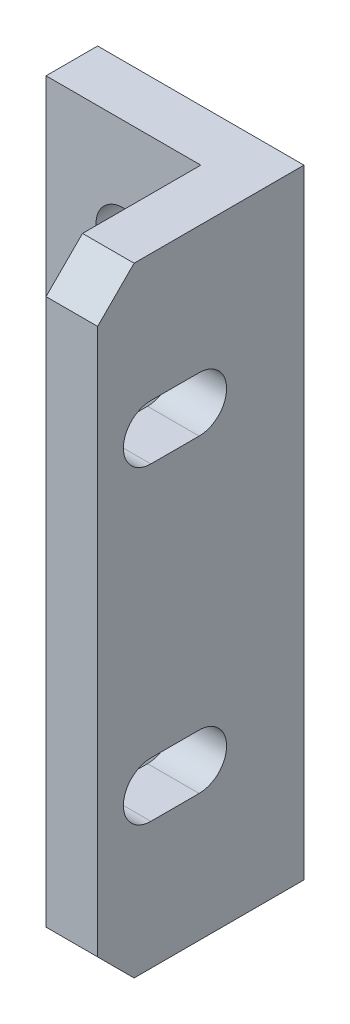
ISO-10303-21;
HEADER;
FILE_DESCRIPTION(('STEP AP214'),'2;1');
FILE_NAME('part.step','',(''),(''),'','','');
FILE_SCHEMA(('AUTOMOTIVE_DESIGN { 1 0 10303 214 1 1 1 1 }'));
ENDSEC;
DATA;
#1=APPLICATION_CONTEXT('core data for automotive mechanical design processes');
#2=APPLICATION_PROTOCOL_DEFINITION('international standard','automotive_design',2000,#1);
#3=PRODUCT_CONTEXT('',#1,'mechanical');
#4=PRODUCT('Part','Part','',(#3));
#5=PRODUCT_RELATED_PRODUCT_CATEGORY('part','',(#4));
#6=PRODUCT_DEFINITION_FORMATION('','',#4);
#7=PRODUCT_DEFINITION_CONTEXT('part definition',#1,'design');
#8=PRODUCT_DEFINITION('design','',#6,#7);
#9=PRODUCT_DEFINITION_SHAPE('','',#8);
#10=(LENGTH_UNIT() NAMED_UNIT(*) SI_UNIT(.MILLI.,.METRE.));
#11=(NAMED_UNIT(*) PLANE_ANGLE_UNIT() SI_UNIT($,.RADIAN.));
#12=(NAMED_UNIT(*) SI_UNIT($,.STERADIAN.) SOLID_ANGLE_UNIT());
#13=UNCERTAINTY_MEASURE_WITH_UNIT(LENGTH_MEASURE(1.E-05),#10,'distance_accuracy_value','');
#14=(GEOMETRIC_REPRESENTATION_CONTEXT(3) GLOBAL_UNCERTAINTY_ASSIGNED_CONTEXT((#13)) GLOBAL_UNIT_ASSIGNED_CONTEXT((#10,
#11,#12)) REPRESENTATION_CONTEXT('',''));
#15=CARTESIAN_POINT('',(0.,0.,0.));
#16=DIRECTION('',(0.,0.,1.));
#17=DIRECTION('',(1.,0.,0.));
#18=AXIS2_PLACEMENT_3D('',#15,#16,#17);
#19=CARTESIAN_POINT('',(0.,0.,0.));
#20=DIRECTION('',(0.,0.,-1.));
#21=DIRECTION('',(-1.,0.,0.));
#22=AXIS2_PLACEMENT_3D('',#19,#20,#21);
#23=PLANE('',#22);
#24=DIRECTION('',(0.,-1.,0.));
#25=VECTOR('',#24,1.);
#26=CARTESIAN_POINT('',(0.,0.,0.));
#27=LINE('',#26,#25);
#28=CARTESIAN_POINT('',(0.,76.2,0.));
#29=VERTEX_POINT('',#28);
#30=CARTESIAN_POINT('',(0.,0.,0.));
#31=VERTEX_POINT('',#30);
#32=EDGE_CURVE('E389',#29,#31,#27,.T.);
#33=ORIENTED_EDGE('',*,*,#32,.F.);
#34=DIRECTION('',(-1.,0.,0.));
#35=VECTOR('',#34,1.);
#36=CARTESIAN_POINT('',(0.,76.2,0.));
#37=LINE('',#36,#35);
#38=CARTESIAN_POINT('',(25.4,76.2,0.));
#39=VERTEX_POINT('',#38);
#40=EDGE_CURVE('E400',#39,#29,#37,.T.);
#41=ORIENTED_EDGE('',*,*,#40,.F.);
#42=DIRECTION('',(0.,1.,0.));
#43=VECTOR('',#42,1.);
#44=CARTESIAN_POINT('',(25.4,0.,0.));
#45=LINE('',#44,#43);
#46=CARTESIAN_POINT('',(25.4,0.,0.));
#47=VERTEX_POINT('',#46);
#48=EDGE_CURVE('E410',#47,#39,#45,.T.);
#49=ORIENTED_EDGE('',*,*,#48,.F.);
#50=DIRECTION('',(1.,0.,0.));
#51=VECTOR('',#50,1.);
#52=CARTESIAN_POINT('',(0.,0.,0.));
#53=LINE('',#52,#51);
#54=EDGE_CURVE('E408',#31,#47,#53,.T.);
#55=ORIENTED_EDGE('',*,*,#54,.F.);
#56=EDGE_LOOP('',(#33,#41,#49,#55));
#57=FACE_BOUND('',#56,.T.);
#58=CARTESIAN_POINT('',(9.525,12.7,0.));
#59=DIRECTION('',(0.,0.,1.));
#60=DIRECTION('',(1.,0.,0.));
#61=AXIS2_PLACEMENT_3D('',#58,#59,#60);
#62=CIRCLE('',#61,3.3782);
#63=CARTESIAN_POINT('',(12.9032,12.7,0.));
#64=VERTEX_POINT('',#63);
#65=EDGE_CURVE('E481',#64,#64,#62,.T.);
#66=ORIENTED_EDGE('',*,*,#65,.T.);
#67=EDGE_LOOP('',(#66));
#68=FACE_BOUND('',#67,.T.);
#69=CARTESIAN_POINT('',(9.525,63.5,0.));
#70=DIRECTION('',(0.,0.,1.));
#71=DIRECTION('',(1.,0.,0.));
#72=AXIS2_PLACEMENT_3D('',#69,#70,#71);
#73=CIRCLE('',#72,3.3782);
#74=CARTESIAN_POINT('',(12.9032,63.5,0.));
#75=VERTEX_POINT('',#74);
#76=EDGE_CURVE('E482',#75,#75,#73,.T.);
#77=ORIENTED_EDGE('',*,*,#76,.T.);
#78=EDGE_LOOP('',(#77));
#79=FACE_BOUND('',#78,.T.);
#80=ADVANCED_FACE('F181',(#57,#68,#79),#23,.T.);
#81=CARTESIAN_POINT('',(0.,0.,6.35));
#82=DIRECTION('',(1.,0.,0.));
#83=DIRECTION('',(0.,0.,-1.));
#84=AXIS2_PLACEMENT_3D('',#81,#82,#83);
#85=PLANE('',#84);
#86=ORIENTED_EDGE('',*,*,#32,.T.);
#87=DIRECTION('',(0.,0.,-1.));
#88=VECTOR('',#87,1.);
#89=CARTESIAN_POINT('',(0.,0.,6.35));
#90=LINE('',#89,#88);
#91=CARTESIAN_POINT('',(0.,0.,6.35));
#92=VERTEX_POINT('',#91);
#93=EDGE_CURVE('E13',#92,#31,#90,.T.);
#94=ORIENTED_EDGE('',*,*,#93,.F.);
#95=DIRECTION('',(0.,-1.,0.));
#96=VECTOR('',#95,1.);
#97=CARTESIAN_POINT('',(0.,0.,6.35));
#98=LINE('',#97,#96);
#99=CARTESIAN_POINT('',(0.,76.2,6.35));
#100=VERTEX_POINT('',#99);
#101=EDGE_CURVE('E396',#100,#92,#98,.T.);
#102=ORIENTED_EDGE('',*,*,#101,.F.);
#103=DIRECTION('',(0.,0.,-1.));
#104=VECTOR('',#103,1.);
#105=CARTESIAN_POINT('',(0.,76.2,6.35));
#106=LINE('',#105,#104);
#107=EDGE_CURVE('E405',#100,#29,#106,.T.);
#108=ORIENTED_EDGE('',*,*,#107,.T.);
#109=EDGE_LOOP('',(#86,#94,#102,#108));
#110=FACE_BOUND('',#109,.T.);
#111=ADVANCED_FACE('F183',(#110),#85,.F.);
#112=CARTESIAN_POINT('',(0.,0.,6.35));
#113=DIRECTION('',(0.,1.,0.));
#114=DIRECTION('',(0.,0.,1.));
#115=AXIS2_PLACEMENT_3D('',#112,#113,#114);
#116=PLANE('',#115);
#117=ORIENTED_EDGE('',*,*,#54,.T.);
#118=DIRECTION('',(0.,0.,-1.));
#119=VECTOR('',#118,1.);
#120=CARTESIAN_POINT('',(25.4,0.,6.35));
#121=LINE('',#120,#119);
#122=CARTESIAN_POINT('',(25.4,0.,20.9098719394654));
#123=VERTEX_POINT('',#122);
#124=EDGE_CURVE('E189',#123,#47,#121,.T.);
#125=ORIENTED_EDGE('',*,*,#124,.F.);
#126=DIRECTION('',(1.,0.,0.));
#127=VECTOR('',#126,1.);
#128=CARTESIAN_POINT('',(19.05,0.,20.9098719394654));
#129=LINE('',#128,#127);
#130=CARTESIAN_POINT('',(19.05,0.,20.9098719394654));
#131=VERTEX_POINT('',#130);
#132=EDGE_CURVE('E386',#131,#123,#129,.T.);
#133=ORIENTED_EDGE('',*,*,#132,.F.);
#134=DIRECTION('',(0.,0.,-1.));
#135=VECTOR('',#134,1.);
#136=CARTESIAN_POINT('',(19.05,0.,6.35));
#137=LINE('',#136,#135);
#138=CARTESIAN_POINT('',(19.05,0.,6.35));
#139=VERTEX_POINT('',#138);
#140=EDGE_CURVE('E373',#131,#139,#137,.T.);
#141=ORIENTED_EDGE('',*,*,#140,.T.);
#142=DIRECTION('',(1.,0.,0.));
#143=VECTOR('',#142,1.);
#144=CARTESIAN_POINT('',(0.,0.,6.35));
#145=LINE('',#144,#143);
#146=EDGE_CURVE('E399',#92,#139,#145,.T.);
#147=ORIENTED_EDGE('',*,*,#146,.F.);
#148=ORIENTED_EDGE('',*,*,#93,.T.);
#149=EDGE_LOOP('',(#117,#125,#133,#141,#147,#148));
#150=FACE_BOUND('',#149,.T.);
#151=ADVANCED_FACE('F450',(#150),#116,.F.);
#152=CARTESIAN_POINT('',(25.4,0.,6.35));
#153=DIRECTION('',(-1.,0.,0.));
#154=DIRECTION('',(0.,0.,1.));
#155=AXIS2_PLACEMENT_3D('',#152,#153,#154);
#156=PLANE('',#155);
#157=DIRECTION('',(0.,0.,1.));
#158=VECTOR('',#157,1.);
#159=CARTESIAN_POINT('',(25.4,53.7718,12.9032));
#160=LINE('',#159,#158);
#161=CARTESIAN_POINT('',(25.4,53.7718,12.9032));
#162=VERTEX_POINT('',#161);
#163=CARTESIAN_POINT('',(25.4,53.7718,18.8468));
#164=VERTEX_POINT('',#163);
#165=EDGE_CURVE('E312',#162,#164,#160,.T.);
#166=ORIENTED_EDGE('',*,*,#165,.T.);
#167=CARTESIAN_POINT('',(25.4,57.15,18.8468));
#168=DIRECTION('',(-1.,0.,0.));
#169=DIRECTION('',(0.,0.,1.));
#170=AXIS2_PLACEMENT_3D('',#167,#168,#169);
#171=CIRCLE('',#170,3.3782);
#172=CARTESIAN_POINT('',(25.4,60.5282,18.8468));
#173=VERTEX_POINT('',#172);
#174=EDGE_CURVE('E311',#164,#173,#171,.T.);
#175=ORIENTED_EDGE('',*,*,#174,.T.);
#176=DIRECTION('',(0.,0.,1.));
#177=VECTOR('',#176,1.);
#178=CARTESIAN_POINT('',(25.4,60.5282,12.9032));
#179=LINE('',#178,#177);
#180=CARTESIAN_POINT('',(25.4,60.5282,12.9032));
#181=VERTEX_POINT('',#180);
#182=EDGE_CURVE('E302',#181,#173,#179,.T.);
#183=ORIENTED_EDGE('',*,*,#182,.F.);
#184=CARTESIAN_POINT('',(25.4,57.15,12.9032));
#185=DIRECTION('',(-1.,0.,0.));
#186=DIRECTION('',(0.,0.,1.));
#187=AXIS2_PLACEMENT_3D('',#184,#185,#186);
#188=CIRCLE('',#187,3.3782);
#189=EDGE_CURVE('E291',#181,#162,#188,.T.);
#190=ORIENTED_EDGE('',*,*,#189,.T.);
#191=EDGE_LOOP('',(#166,#175,#183,#190));
#192=FACE_BOUND('',#191,.T.);
#193=DIRECTION('',(0.,0.,1.));
#194=VECTOR('',#193,1.);
#195=CARTESIAN_POINT('',(25.4,15.6718,12.9032));
#196=LINE('',#195,#194);
#197=CARTESIAN_POINT('',(25.4,15.6718,12.9032));
#198=VERTEX_POINT('',#197);
#199=CARTESIAN_POINT('',(25.4,15.6718,18.8468));
#200=VERTEX_POINT('',#199);
#201=EDGE_CURVE('E331',#198,#200,#196,.T.);
#202=ORIENTED_EDGE('',*,*,#201,.T.);
#203=CARTESIAN_POINT('',(25.4,19.05,18.8468));
#204=DIRECTION('',(-1.,0.,0.));
#205=DIRECTION('',(0.,0.,1.));
#206=AXIS2_PLACEMENT_3D('',#203,#204,#205);
#207=CIRCLE('',#206,3.3782);
#208=CARTESIAN_POINT('',(25.4,22.4282,18.8468));
#209=VERTEX_POINT('',#208);
#210=EDGE_CURVE('E354',#200,#209,#207,.T.);
#211=ORIENTED_EDGE('',*,*,#210,.T.);
#212=DIRECTION('',(0.,0.,1.));
#213=VECTOR('',#212,1.);
#214=CARTESIAN_POINT('',(25.4,22.4282,12.9032));
#215=LINE('',#214,#213);
#216=CARTESIAN_POINT('',(25.4,22.4282,12.9032));
#217=VERTEX_POINT('',#216);
#218=EDGE_CURVE('E334',#217,#209,#215,.T.);
#219=ORIENTED_EDGE('',*,*,#218,.F.);
#220=CARTESIAN_POINT('',(25.4,19.05,12.9032));
#221=DIRECTION('',(-1.,0.,0.));
#222=DIRECTION('',(0.,0.,1.));
#223=AXIS2_PLACEMENT_3D('',#220,#221,#222);
#224=CIRCLE('',#223,3.3782);
#225=EDGE_CURVE('E345',#217,#198,#224,.T.);
#226=ORIENTED_EDGE('',*,*,#225,.T.);
#227=EDGE_LOOP('',(#202,#211,#219,#226));
#228=FACE_BOUND('',#227,.T.);
#229=ORIENTED_EDGE('',*,*,#48,.T.);
#230=DIRECTION('',(0.,0.,-1.));
#231=VECTOR('',#230,1.);
#232=CARTESIAN_POINT('',(25.4,76.2,6.35));
#233=LINE('',#232,#231);
#234=CARTESIAN_POINT('',(25.4,76.2,20.9098719394655));
#235=VERTEX_POINT('',#234);
#236=EDGE_CURVE('E415',#235,#39,#233,.T.);
#237=ORIENTED_EDGE('',*,*,#236,.F.);
#238=DIRECTION('',(0.,-0.707106781186558,0.707106781186537));
#239=VECTOR('',#238,1.);
#240=CARTESIAN_POINT('',(25.4,71.7098719394654,25.4));
#241=LINE('',#240,#239);
#242=CARTESIAN_POINT('',(25.4,71.7098719394654,25.4));
#243=VERTEX_POINT('',#242);
#244=EDGE_CURVE('E359',#235,#243,#241,.T.);
#245=ORIENTED_EDGE('',*,*,#244,.T.);
#246=DIRECTION('',(0.,-1.,0.));
#247=VECTOR('',#246,1.);
#248=CARTESIAN_POINT('',(25.4,4.49012806053452,25.4));
#249=LINE('',#248,#247);
#250=CARTESIAN_POINT('',(25.4,4.49012806053452,25.4));
#251=VERTEX_POINT('',#250);
#252=EDGE_CURVE('E381',#243,#251,#249,.T.);
#253=ORIENTED_EDGE('',*,*,#252,.T.);
#254=DIRECTION('',(0.,-0.707106781186538,-0.707106781186557));
#255=VECTOR('',#254,1.);
#256=CARTESIAN_POINT('',(25.4,0.,20.9098719394654));
#257=LINE('',#256,#255);
#258=EDGE_CURVE('E364',#251,#123,#257,.T.);
#259=ORIENTED_EDGE('',*,*,#258,.T.);
#260=ORIENTED_EDGE('',*,*,#124,.T.);
#261=EDGE_LOOP('',(#229,#237,#245,#253,#259,#260));
#262=FACE_BOUND('',#261,.T.);
#263=ADVANCED_FACE('F308',(#192,#228,#262),#156,.F.);
#264=CARTESIAN_POINT('',(0.,76.2,6.35));
#265=DIRECTION('',(0.,-1.,0.));
#266=DIRECTION('',(0.,0.,-1.));
#267=AXIS2_PLACEMENT_3D('',#264,#265,#266);
#268=PLANE('',#267);
#269=ORIENTED_EDGE('',*,*,#40,.T.);
#270=ORIENTED_EDGE('',*,*,#107,.F.);
#271=DIRECTION('',(-1.,0.,0.));
#272=VECTOR('',#271,1.);
#273=CARTESIAN_POINT('',(0.,76.2,6.35));
#274=LINE('',#273,#272);
#275=CARTESIAN_POINT('',(19.05,76.2,6.35));
#276=VERTEX_POINT('',#275);
#277=EDGE_CURVE('E403',#276,#100,#274,.T.);
#278=ORIENTED_EDGE('',*,*,#277,.F.);
#279=DIRECTION('',(0.,0.,1.));
#280=VECTOR('',#279,1.);
#281=CARTESIAN_POINT('',(19.05,76.2,20.9098719394655));
#282=LINE('',#281,#280);
#283=CARTESIAN_POINT('',(19.05,76.2,20.9098719394655));
#284=VERTEX_POINT('',#283);
#285=EDGE_CURVE('E360',#276,#284,#282,.T.);
#286=ORIENTED_EDGE('',*,*,#285,.T.);
#287=DIRECTION('',(1.,0.,0.));
#288=VECTOR('',#287,1.);
#289=CARTESIAN_POINT('',(19.05,76.2,20.9098719394655));
#290=LINE('',#289,#288);
#291=EDGE_CURVE('E378',#284,#235,#290,.T.);
#292=ORIENTED_EDGE('',*,*,#291,.T.);
#293=ORIENTED_EDGE('',*,*,#236,.T.);
#294=EDGE_LOOP('',(#269,#270,#278,#286,#292,#293));
#295=FACE_BOUND('',#294,.T.);
#296=ADVANCED_FACE('F428',(#295),#268,.F.);
#297=CARTESIAN_POINT('',(0.,0.,6.35));
#298=DIRECTION('',(0.,0.,-1.));
#299=DIRECTION('',(-1.,0.,0.));
#300=AXIS2_PLACEMENT_3D('',#297,#298,#299);
#301=PLANE('',#300);
#302=CARTESIAN_POINT('',(9.525,63.5,6.35));
#303=DIRECTION('',(0.,0.,1.));
#304=DIRECTION('',(1.,0.,0.));
#305=AXIS2_PLACEMENT_3D('',#302,#303,#304);
#306=CIRCLE('',#305,3.37819999999999);
#307=CARTESIAN_POINT('',(12.9032,63.5,6.35));
#308=VERTEX_POINT('',#307);
#309=EDGE_CURVE('E476',#308,#308,#306,.T.);
#310=ORIENTED_EDGE('',*,*,#309,.F.);
#311=EDGE_LOOP('',(#310));
#312=FACE_BOUND('',#311,.T.);
#313=CARTESIAN_POINT('',(9.525,12.7,6.35));
#314=DIRECTION('',(0.,0.,1.));
#315=DIRECTION('',(1.,0.,0.));
#316=AXIS2_PLACEMENT_3D('',#313,#314,#315);
#317=CIRCLE('',#316,3.37819999999999);
#318=CARTESIAN_POINT('',(12.9032,12.7,6.35));
#319=VERTEX_POINT('',#318);
#320=EDGE_CURVE('E479',#319,#319,#317,.T.);
#321=ORIENTED_EDGE('',*,*,#320,.F.);
#322=EDGE_LOOP('',(#321));
#323=FACE_BOUND('',#322,.T.);
#324=ORIENTED_EDGE('',*,*,#146,.T.);
#325=DIRECTION('',(0.,1.,0.));
#326=VECTOR('',#325,1.);
#327=CARTESIAN_POINT('',(19.05,76.2,6.35));
#328=LINE('',#327,#326);
#329=EDGE_CURVE('E375',#139,#276,#328,.T.);
#330=ORIENTED_EDGE('',*,*,#329,.T.);
#331=ORIENTED_EDGE('',*,*,#277,.T.);
#332=ORIENTED_EDGE('',*,*,#101,.T.);
#333=EDGE_LOOP('',(#324,#330,#331,#332));
#334=FACE_BOUND('',#333,.T.);
#335=ADVANCED_FACE('F434',(#312,#323,#334),#301,.F.);
#336=CARTESIAN_POINT('',(19.05,0.,20.9098719394654));
#337=DIRECTION('',(0.,-0.707106781186557,0.707106781186538));
#338=DIRECTION('',(0.,-0.707106781186538,-0.707106781186557));
#339=AXIS2_PLACEMENT_3D('',#336,#337,#338);
#340=PLANE('',#339);
#341=ORIENTED_EDGE('',*,*,#258,.F.);
#342=DIRECTION('',(1.,0.,0.));
#343=VECTOR('',#342,1.);
#344=CARTESIAN_POINT('',(19.05,4.49012806053452,25.4));
#345=LINE('',#344,#343);
#346=CARTESIAN_POINT('',(19.05,4.49012806053452,25.4));
#347=VERTEX_POINT('',#346);
#348=EDGE_CURVE('E390',#347,#251,#345,.T.);
#349=ORIENTED_EDGE('',*,*,#348,.F.);
#350=DIRECTION('',(0.,-0.707106781186538,-0.707106781186557));
#351=VECTOR('',#350,1.);
#352=CARTESIAN_POINT('',(19.05,0.,20.9098719394654));
#353=LINE('',#352,#351);
#354=EDGE_CURVE('E370',#347,#131,#353,.T.);
#355=ORIENTED_EDGE('',*,*,#354,.T.);
#356=ORIENTED_EDGE('',*,*,#132,.T.);
#357=EDGE_LOOP('',(#341,#349,#355,#356));
#358=FACE_BOUND('',#357,.T.);
#359=ADVANCED_FACE('F449',(#358),#340,.T.);
#360=CARTESIAN_POINT('',(19.05,4.49012806053452,25.4));
#361=DIRECTION('',(0.,0.,1.));
#362=DIRECTION('',(1.,0.,0.));
#363=AXIS2_PLACEMENT_3D('',#360,#361,#362);
#364=PLANE('',#363);
#365=ORIENTED_EDGE('',*,*,#252,.F.);
#366=DIRECTION('',(1.,0.,0.));
#367=VECTOR('',#366,1.);
#368=CARTESIAN_POINT('',(19.05,71.7098719394654,25.4));
#369=LINE('',#368,#367);
#370=CARTESIAN_POINT('',(19.05,71.7098719394654,25.4));
#371=VERTEX_POINT('',#370);
#372=EDGE_CURVE('E392',#371,#243,#369,.T.);
#373=ORIENTED_EDGE('',*,*,#372,.F.);
#374=DIRECTION('',(0.,-1.,0.));
#375=VECTOR('',#374,1.);
#376=CARTESIAN_POINT('',(19.05,4.49012806053452,25.4));
#377=LINE('',#376,#375);
#378=EDGE_CURVE('E367',#371,#347,#377,.T.);
#379=ORIENTED_EDGE('',*,*,#378,.T.);
#380=ORIENTED_EDGE('',*,*,#348,.T.);
#381=EDGE_LOOP('',(#365,#373,#379,#380));
#382=FACE_BOUND('',#381,.T.);
#383=ADVANCED_FACE('F447',(#382),#364,.T.);
#384=CARTESIAN_POINT('',(19.05,71.7098719394654,25.4));
#385=DIRECTION('',(0.,0.707106781186537,0.707106781186558));
#386=DIRECTION('',(0.,-0.707106781186558,0.707106781186537));
#387=AXIS2_PLACEMENT_3D('',#384,#385,#386);
#388=PLANE('',#387);
#389=ORIENTED_EDGE('',*,*,#244,.F.);
#390=ORIENTED_EDGE('',*,*,#291,.F.);
#391=DIRECTION('',(0.,-0.707106781186558,0.707106781186537));
#392=VECTOR('',#391,1.);
#393=CARTESIAN_POINT('',(19.05,71.7098719394654,25.4));
#394=LINE('',#393,#392);
#395=EDGE_CURVE('E363',#284,#371,#394,.T.);
#396=ORIENTED_EDGE('',*,*,#395,.T.);
#397=ORIENTED_EDGE('',*,*,#372,.T.);
#398=EDGE_LOOP('',(#389,#390,#396,#397));
#399=FACE_BOUND('',#398,.T.);
#400=ADVANCED_FACE('F444',(#399),#388,.T.);
#401=CARTESIAN_POINT('',(19.05,0.,0.));
#402=DIRECTION('',(-1.,0.,0.));
#403=DIRECTION('',(0.,0.,1.));
#404=AXIS2_PLACEMENT_3D('',#401,#402,#403);
#405=PLANE('',#404);
#406=DIRECTION('',(0.,0.,1.));
#407=VECTOR('',#406,1.);
#408=CARTESIAN_POINT('',(19.05,53.7718,12.9032));
#409=LINE('',#408,#407);
#410=CARTESIAN_POINT('',(19.05,53.7718,12.9032));
#411=VERTEX_POINT('',#410);
#412=CARTESIAN_POINT('',(19.05,53.7718,18.8468));
#413=VERTEX_POINT('',#412);
#414=EDGE_CURVE('E315',#411,#413,#409,.T.);
#415=ORIENTED_EDGE('',*,*,#414,.F.);
#416=CARTESIAN_POINT('',(19.05,57.15,12.9032));
#417=DIRECTION('',(-1.,0.,0.));
#418=DIRECTION('',(0.,0.,1.));
#419=AXIS2_PLACEMENT_3D('',#416,#417,#418);
#420=CIRCLE('',#419,3.3782);
#421=CARTESIAN_POINT('',(19.05,60.5282,12.9032));
#422=VERTEX_POINT('',#421);
#423=EDGE_CURVE('E296',#422,#411,#420,.T.);
#424=ORIENTED_EDGE('',*,*,#423,.F.);
#425=DIRECTION('',(0.,0.,1.));
#426=VECTOR('',#425,1.);
#427=CARTESIAN_POINT('',(19.05,60.5282,12.9032));
#428=LINE('',#427,#426);
#429=CARTESIAN_POINT('',(19.05,60.5282,18.8468));
#430=VERTEX_POINT('',#429);
#431=EDGE_CURVE('E305',#422,#430,#428,.T.);
#432=ORIENTED_EDGE('',*,*,#431,.T.);
#433=CARTESIAN_POINT('',(19.05,57.15,18.8468));
#434=DIRECTION('',(-1.,0.,0.));
#435=DIRECTION('',(0.,0.,1.));
#436=AXIS2_PLACEMENT_3D('',#433,#434,#435);
#437=CIRCLE('',#436,3.3782);
#438=EDGE_CURVE('E323',#413,#430,#437,.T.);
#439=ORIENTED_EDGE('',*,*,#438,.F.);
#440=EDGE_LOOP('',(#415,#424,#432,#439));
#441=FACE_BOUND('',#440,.T.);
#442=CARTESIAN_POINT('',(19.05,19.05,12.9032));
#443=DIRECTION('',(-1.,0.,0.));
#444=DIRECTION('',(0.,0.,1.));
#445=AXIS2_PLACEMENT_3D('',#442,#443,#444);
#446=CIRCLE('',#445,3.3782);
#447=CARTESIAN_POINT('',(19.05,22.4282,12.9032));
#448=VERTEX_POINT('',#447);
#449=CARTESIAN_POINT('',(19.05,15.6718,12.9032));
#450=VERTEX_POINT('',#449);
#451=EDGE_CURVE('E342',#448,#450,#446,.T.);
#452=ORIENTED_EDGE('',*,*,#451,.F.);
#453=DIRECTION('',(0.,0.,1.));
#454=VECTOR('',#453,1.);
#455=CARTESIAN_POINT('',(19.05,22.4282,12.9032));
#456=LINE('',#455,#454);
#457=CARTESIAN_POINT('',(19.05,22.4282,18.8468));
#458=VERTEX_POINT('',#457);
#459=EDGE_CURVE('E337',#448,#458,#456,.T.);
#460=ORIENTED_EDGE('',*,*,#459,.T.);
#461=CARTESIAN_POINT('',(19.05,19.05,18.8468));
#462=DIRECTION('',(-1.,0.,0.));
#463=DIRECTION('',(0.,0.,1.));
#464=AXIS2_PLACEMENT_3D('',#461,#462,#463);
#465=CIRCLE('',#464,3.3782);
#466=CARTESIAN_POINT('',(19.05,15.6718,18.8468));
#467=VERTEX_POINT('',#466);
#468=EDGE_CURVE('E352',#467,#458,#465,.T.);
#469=ORIENTED_EDGE('',*,*,#468,.F.);
#470=DIRECTION('',(0.,0.,1.));
#471=VECTOR('',#470,1.);
#472=CARTESIAN_POINT('',(19.05,15.6718,12.9032));
#473=LINE('',#472,#471);
#474=EDGE_CURVE('E328',#450,#467,#473,.T.);
#475=ORIENTED_EDGE('',*,*,#474,.F.);
#476=EDGE_LOOP('',(#452,#460,#469,#475));
#477=FACE_BOUND('',#476,.T.);
#478=ORIENTED_EDGE('',*,*,#285,.F.);
#479=ORIENTED_EDGE('',*,*,#329,.F.);
#480=ORIENTED_EDGE('',*,*,#140,.F.);
#481=ORIENTED_EDGE('',*,*,#354,.F.);
#482=ORIENTED_EDGE('',*,*,#378,.F.);
#483=ORIENTED_EDGE('',*,*,#395,.F.);
#484=EDGE_LOOP('',(#478,#479,#480,#481,#482,#483));
#485=FACE_BOUND('',#484,.T.);
#486=ADVANCED_FACE('F439',(#441,#477,#485),#405,.T.);
#487=CARTESIAN_POINT('',(19.05,19.05,18.8468));
#488=DIRECTION('',(-1.,0.,0.));
#489=DIRECTION('',(0.,0.,1.));
#490=AXIS2_PLACEMENT_3D('',#487,#488,#489);
#491=CYLINDRICAL_SURFACE('',#490,3.3782);
#492=ORIENTED_EDGE('',*,*,#468,.T.);
#493=DIRECTION('',(1.,0.,0.));
#494=VECTOR('',#493,1.);
#495=CARTESIAN_POINT('',(25.4,22.4282,18.8468));
#496=LINE('',#495,#494);
#497=EDGE_CURVE('E350',#458,#209,#496,.T.);
#498=ORIENTED_EDGE('',*,*,#497,.T.);
#499=ORIENTED_EDGE('',*,*,#210,.F.);
#500=DIRECTION('',(-1.,0.,0.));
#501=VECTOR('',#500,1.);
#502=CARTESIAN_POINT('',(19.05,15.6718,18.8468));
#503=LINE('',#502,#501);
#504=EDGE_CURVE('E357',#467,#200,#503,.F.);
#505=ORIENTED_EDGE('',*,*,#504,.F.);
#506=EDGE_LOOP('',(#492,#498,#499,#505));
#507=FACE_BOUND('',#506,.T.);
#508=ADVANCED_FACE('F499',(#507),#491,.F.);
#509=CARTESIAN_POINT('',(19.05,19.05,12.9032));
#510=DIRECTION('',(-1.,0.,0.));
#511=DIRECTION('',(0.,0.,1.));
#512=AXIS2_PLACEMENT_3D('',#509,#510,#511);
#513=CYLINDRICAL_SURFACE('',#512,3.3782);
#514=ORIENTED_EDGE('',*,*,#225,.F.);
#515=DIRECTION('',(1.,0.,0.));
#516=VECTOR('',#515,1.);
#517=CARTESIAN_POINT('',(25.4,22.4282,12.9032));
#518=LINE('',#517,#516);
#519=EDGE_CURVE('E340',#448,#217,#518,.T.);
#520=ORIENTED_EDGE('',*,*,#519,.F.);
#521=ORIENTED_EDGE('',*,*,#451,.T.);
#522=DIRECTION('',(-1.,0.,0.));
#523=VECTOR('',#522,1.);
#524=CARTESIAN_POINT('',(19.05,15.6718,12.9032));
#525=LINE('',#524,#523);
#526=EDGE_CURVE('E348',#198,#450,#525,.T.);
#527=ORIENTED_EDGE('',*,*,#526,.F.);
#528=EDGE_LOOP('',(#514,#520,#521,#527));
#529=FACE_BOUND('',#528,.T.);
#530=ADVANCED_FACE('F508',(#529),#513,.F.);
#531=CARTESIAN_POINT('',(25.4,22.4282,12.9032));
#532=DIRECTION('',(0.,-1.,0.));
#533=DIRECTION('',(1.,0.,0.));
#534=AXIS2_PLACEMENT_3D('',#531,#532,#533);
#535=PLANE('',#534);
#536=ORIENTED_EDGE('',*,*,#497,.F.);
#537=ORIENTED_EDGE('',*,*,#459,.F.);
#538=ORIENTED_EDGE('',*,*,#519,.T.);
#539=ORIENTED_EDGE('',*,*,#218,.T.);
#540=EDGE_LOOP('',(#536,#537,#538,#539));
#541=FACE_BOUND('',#540,.T.);
#542=ADVANCED_FACE('F512',(#541),#535,.T.);
#543=CARTESIAN_POINT('',(19.05,15.6718,12.9032));
#544=DIRECTION('',(0.,-1.,0.));
#545=DIRECTION('',(0.,0.,-1.));
#546=AXIS2_PLACEMENT_3D('',#543,#544,#545);
#547=PLANE('',#546);
#548=ORIENTED_EDGE('',*,*,#504,.T.);
#549=ORIENTED_EDGE('',*,*,#201,.F.);
#550=ORIENTED_EDGE('',*,*,#526,.T.);
#551=ORIENTED_EDGE('',*,*,#474,.T.);
#552=EDGE_LOOP('',(#548,#549,#550,#551));
#553=FACE_BOUND('',#552,.T.);
#554=ADVANCED_FACE('F516',(#553),#547,.F.);
#555=CARTESIAN_POINT('',(19.05,57.15,18.8468));
#556=DIRECTION('',(-1.,0.,0.));
#557=DIRECTION('',(0.,0.,1.));
#558=AXIS2_PLACEMENT_3D('',#555,#556,#557);
#559=CYLINDRICAL_SURFACE('',#558,3.3782);
#560=ORIENTED_EDGE('',*,*,#438,.T.);
#561=DIRECTION('',(1.,0.,0.));
#562=VECTOR('',#561,1.);
#563=CARTESIAN_POINT('',(25.4,60.5282,18.8468));
#564=LINE('',#563,#562);
#565=EDGE_CURVE('E321',#430,#173,#564,.T.);
#566=ORIENTED_EDGE('',*,*,#565,.T.);
#567=ORIENTED_EDGE('',*,*,#174,.F.);
#568=DIRECTION('',(-1.,0.,0.));
#569=VECTOR('',#568,1.);
#570=CARTESIAN_POINT('',(19.05,53.7718,18.8468));
#571=LINE('',#570,#569);
#572=EDGE_CURVE('E326',#413,#164,#571,.F.);
#573=ORIENTED_EDGE('',*,*,#572,.F.);
#574=EDGE_LOOP('',(#560,#566,#567,#573));
#575=FACE_BOUND('',#574,.T.);
#576=ADVANCED_FACE('F496',(#575),#559,.F.);
#577=CARTESIAN_POINT('',(19.05,57.15,12.9032));
#578=DIRECTION('',(-1.,0.,0.));
#579=DIRECTION('',(0.,0.,1.));
#580=AXIS2_PLACEMENT_3D('',#577,#578,#579);
#581=CYLINDRICAL_SURFACE('',#580,3.3782);
#582=ORIENTED_EDGE('',*,*,#189,.F.);
#583=DIRECTION('',(1.,0.,0.));
#584=VECTOR('',#583,1.);
#585=CARTESIAN_POINT('',(25.4,60.5282,12.9032));
#586=LINE('',#585,#584);
#587=EDGE_CURVE('E201',#422,#181,#586,.T.);
#588=ORIENTED_EDGE('',*,*,#587,.F.);
#589=ORIENTED_EDGE('',*,*,#423,.T.);
#590=DIRECTION('',(-1.,0.,0.));
#591=VECTOR('',#590,1.);
#592=CARTESIAN_POINT('',(19.05,53.7718,12.9032));
#593=LINE('',#592,#591);
#594=EDGE_CURVE('E196',#162,#411,#593,.T.);
#595=ORIENTED_EDGE('',*,*,#594,.F.);
#596=EDGE_LOOP('',(#582,#588,#589,#595));
#597=FACE_BOUND('',#596,.T.);
#598=ADVANCED_FACE('F292',(#597),#581,.F.);
#599=CARTESIAN_POINT('',(25.4,60.5282,12.9032));
#600=DIRECTION('',(0.,-1.,0.));
#601=DIRECTION('',(1.,0.,0.));
#602=AXIS2_PLACEMENT_3D('',#599,#600,#601);
#603=PLANE('',#602);
#604=ORIENTED_EDGE('',*,*,#565,.F.);
#605=ORIENTED_EDGE('',*,*,#431,.F.);
#606=ORIENTED_EDGE('',*,*,#587,.T.);
#607=ORIENTED_EDGE('',*,*,#182,.T.);
#608=EDGE_LOOP('',(#604,#605,#606,#607));
#609=FACE_BOUND('',#608,.T.);
#610=ADVANCED_FACE('F301',(#609),#603,.T.);
#611=CARTESIAN_POINT('',(19.05,53.7718,12.9032));
#612=DIRECTION('',(0.,-1.,0.));
#613=DIRECTION('',(0.,0.,-1.));
#614=AXIS2_PLACEMENT_3D('',#611,#612,#613);
#615=PLANE('',#614);
#616=ORIENTED_EDGE('',*,*,#572,.T.);
#617=ORIENTED_EDGE('',*,*,#165,.F.);
#618=ORIENTED_EDGE('',*,*,#594,.T.);
#619=ORIENTED_EDGE('',*,*,#414,.T.);
#620=EDGE_LOOP('',(#616,#617,#618,#619));
#621=FACE_BOUND('',#620,.T.);
#622=ADVANCED_FACE('F492',(#621),#615,.F.);
#623=CARTESIAN_POINT('',(9.525,12.7,6.35));
#624=DIRECTION('',(0.,0.,1.));
#625=DIRECTION('',(1.,0.,0.));
#626=AXIS2_PLACEMENT_3D('',#623,#624,#625);
#627=CYLINDRICAL_SURFACE('',#626,3.37819999999999);
#628=ORIENTED_EDGE('',*,*,#65,.F.);
#629=EDGE_LOOP('',(#628));
#630=FACE_BOUND('',#629,.T.);
#631=ORIENTED_EDGE('',*,*,#320,.T.);
#632=EDGE_LOOP('',(#631));
#633=FACE_BOUND('',#632,.T.);
#634=ADVANCED_FACE('F587',(#630,#633),#627,.F.);
#635=CARTESIAN_POINT('',(9.525,63.5,6.35));
#636=DIRECTION('',(0.,0.,1.));
#637=DIRECTION('',(1.,0.,0.));
#638=AXIS2_PLACEMENT_3D('',#635,#636,#637);
#639=CYLINDRICAL_SURFACE('',#638,3.37819999999999);
#640=ORIENTED_EDGE('',*,*,#76,.F.);
#641=EDGE_LOOP('',(#640));
#642=FACE_BOUND('',#641,.T.);
#643=ORIENTED_EDGE('',*,*,#309,.T.);
#644=EDGE_LOOP('',(#643));
#645=FACE_BOUND('',#644,.T.);
#646=ADVANCED_FACE('F607',(#642,#645),#639,.F.);
#647=CLOSED_SHELL('',(#80,#111,#151,#263,#296,#335,#359,#383,#400,#486,#508,#530,#542,#554,#576,
#598,#610,#622,#634,#646));
#648=MANIFOLD_SOLID_BREP('B2',#647);
#649=ADVANCED_BREP_SHAPE_REPRESENTATION('',(#18,#648),#14);
#650=SHAPE_DEFINITION_REPRESENTATION(#9,#649);
ENDSEC;
END-ISO-10303-21;
